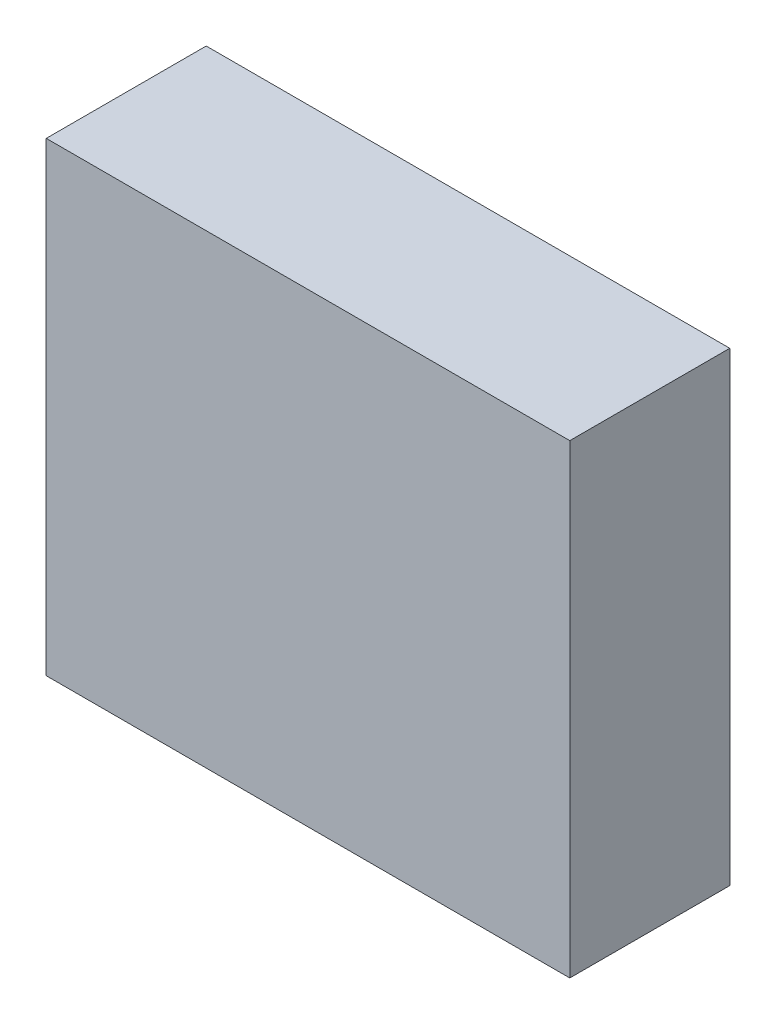
ISO-10303-21;
HEADER;
FILE_DESCRIPTION(('STEP AP214'),'2;1');
FILE_NAME('part.step','',(''),(''),'','','');
FILE_SCHEMA(('AUTOMOTIVE_DESIGN { 1 0 10303 214 1 1 1 1 }'));
ENDSEC;
DATA;
#1=APPLICATION_CONTEXT('core data for automotive mechanical design processes');
#2=APPLICATION_PROTOCOL_DEFINITION('international standard','automotive_design',2000,#1);
#3=PRODUCT_CONTEXT('',#1,'mechanical');
#4=PRODUCT('Part','Part','',(#3));
#5=PRODUCT_RELATED_PRODUCT_CATEGORY('part','',(#4));
#6=PRODUCT_DEFINITION_FORMATION('','',#4);
#7=PRODUCT_DEFINITION_CONTEXT('part definition',#1,'design');
#8=PRODUCT_DEFINITION('design','',#6,#7);
#9=PRODUCT_DEFINITION_SHAPE('','',#8);
#10=(LENGTH_UNIT() NAMED_UNIT(*) SI_UNIT(.MILLI.,.METRE.));
#11=(NAMED_UNIT(*) PLANE_ANGLE_UNIT() SI_UNIT($,.RADIAN.));
#12=(NAMED_UNIT(*) SI_UNIT($,.STERADIAN.) SOLID_ANGLE_UNIT());
#13=UNCERTAINTY_MEASURE_WITH_UNIT(LENGTH_MEASURE(1.E-05),#10,'distance_accuracy_value','');
#14=(GEOMETRIC_REPRESENTATION_CONTEXT(3) GLOBAL_UNCERTAINTY_ASSIGNED_CONTEXT((#13)) GLOBAL_UNIT_ASSIGNED_CONTEXT((#10,
#11,#12)) REPRESENTATION_CONTEXT('',''));
#15=CARTESIAN_POINT('',(0.,0.,0.));
#16=DIRECTION('',(0.,0.,1.));
#17=DIRECTION('',(1.,0.,0.));
#18=AXIS2_PLACEMENT_3D('',#15,#16,#17);
#19=CARTESIAN_POINT('',(-0.90000074,-0.80000094,0.5499989));
#20=DIRECTION('',(0.,0.,1.));
#21=DIRECTION('',(1.,0.,0.));
#22=AXIS2_PLACEMENT_3D('',#19,#20,#21);
#23=PLANE('',#22);
#24=DIRECTION('',(-1.,0.,0.));
#25=VECTOR('',#24,1.);
#26=CARTESIAN_POINT('',(0.90000074,-0.80000094,0.5499989));
#27=LINE('',#26,#25);
#28=CARTESIAN_POINT('',(0.90000074,-0.80000094,0.5499989));
#29=VERTEX_POINT('',#28);
#30=CARTESIAN_POINT('',(-0.90000074,-0.80000094,0.5499989));
#31=VERTEX_POINT('',#30);
#32=EDGE_CURVE('E26',#29,#31,#27,.T.);
#33=ORIENTED_EDGE('',*,*,#32,.F.);
#34=DIRECTION('',(0.,-1.,0.));
#35=VECTOR('',#34,1.);
#36=CARTESIAN_POINT('',(0.90000074,0.80000094,0.5499989));
#37=LINE('',#36,#35);
#38=CARTESIAN_POINT('',(0.90000074,0.80000094,0.5499989));
#39=VERTEX_POINT('',#38);
#40=EDGE_CURVE('E20',#39,#29,#37,.T.);
#41=ORIENTED_EDGE('',*,*,#40,.F.);
#42=DIRECTION('',(1.,0.,0.));
#43=VECTOR('',#42,1.);
#44=CARTESIAN_POINT('',(-0.90000074,0.80000094,0.5499989));
#45=LINE('',#44,#43);
#46=CARTESIAN_POINT('',(-0.90000074,0.80000094,0.5499989));
#47=VERTEX_POINT('',#46);
#48=EDGE_CURVE('E71',#47,#39,#45,.T.);
#49=ORIENTED_EDGE('',*,*,#48,.F.);
#50=DIRECTION('',(0.,1.,0.));
#51=VECTOR('',#50,1.);
#52=CARTESIAN_POINT('',(-0.90000074,-0.80000094,0.5499989));
#53=LINE('',#52,#51);
#54=EDGE_CURVE('E108',#31,#47,#53,.T.);
#55=ORIENTED_EDGE('',*,*,#54,.F.);
#56=EDGE_LOOP('',(#33,#41,#49,#55));
#57=FACE_BOUND('',#56,.T.);
#58=ADVANCED_FACE('F17',(#57),#23,.T.);
#59=CARTESIAN_POINT('',(-0.90000074,-0.80000094,0.));
#60=DIRECTION('',(0.,0.,1.));
#61=DIRECTION('',(1.,0.,0.));
#62=AXIS2_PLACEMENT_3D('',#59,#60,#61);
#63=PLANE('',#62);
#64=DIRECTION('',(0.,1.,0.));
#65=VECTOR('',#64,1.);
#66=CARTESIAN_POINT('',(-0.90000074,-0.80000094,0.));
#67=LINE('',#66,#65);
#68=CARTESIAN_POINT('',(-0.90000074,-0.80000094,0.));
#69=VERTEX_POINT('',#68);
#70=CARTESIAN_POINT('',(-0.90000074,0.80000094,0.));
#71=VERTEX_POINT('',#70);
#72=EDGE_CURVE('E91',#69,#71,#67,.T.);
#73=ORIENTED_EDGE('',*,*,#72,.T.);
#74=DIRECTION('',(1.,0.,0.));
#75=VECTOR('',#74,1.);
#76=CARTESIAN_POINT('',(-0.90000074,0.80000094,0.));
#77=LINE('',#76,#75);
#78=CARTESIAN_POINT('',(0.90000074,0.80000094,0.));
#79=VERTEX_POINT('',#78);
#80=EDGE_CURVE('E77',#71,#79,#77,.T.);
#81=ORIENTED_EDGE('',*,*,#80,.T.);
#82=DIRECTION('',(0.,-1.,0.));
#83=VECTOR('',#82,1.);
#84=CARTESIAN_POINT('',(0.90000074,0.80000094,0.));
#85=LINE('',#84,#83);
#86=CARTESIAN_POINT('',(0.90000074,-0.80000094,0.));
#87=VERTEX_POINT('',#86);
#88=EDGE_CURVE('E81',#79,#87,#85,.T.);
#89=ORIENTED_EDGE('',*,*,#88,.T.);
#90=DIRECTION('',(-1.,0.,0.));
#91=VECTOR('',#90,1.);
#92=CARTESIAN_POINT('',(0.90000074,-0.80000094,0.));
#93=LINE('',#92,#91);
#94=EDGE_CURVE('E11',#87,#69,#93,.T.);
#95=ORIENTED_EDGE('',*,*,#94,.T.);
#96=EDGE_LOOP('',(#73,#81,#89,#95));
#97=FACE_BOUND('',#96,.T.);
#98=ADVANCED_FACE('F103',(#97),#63,.F.);
#99=CARTESIAN_POINT('',(0.90000074,-0.80000094,0.));
#100=DIRECTION('',(0.,-1.,0.));
#101=DIRECTION('',(0.,0.,-1.));
#102=AXIS2_PLACEMENT_3D('',#99,#100,#101);
#103=PLANE('',#102);
#104=DIRECTION('',(0.,0.,1.));
#105=VECTOR('',#104,1.);
#106=CARTESIAN_POINT('',(0.90000074,-0.80000094,0.));
#107=LINE('',#106,#105);
#108=EDGE_CURVE('E76',#87,#29,#107,.T.);
#109=ORIENTED_EDGE('',*,*,#108,.T.);
#110=ORIENTED_EDGE('',*,*,#32,.T.);
#111=DIRECTION('',(0.,0.,1.));
#112=VECTOR('',#111,1.);
#113=CARTESIAN_POINT('',(-0.90000074,-0.80000094,0.));
#114=LINE('',#113,#112);
#115=EDGE_CURVE('E114',#69,#31,#114,.T.);
#116=ORIENTED_EDGE('',*,*,#115,.F.);
#117=ORIENTED_EDGE('',*,*,#94,.F.);
#118=EDGE_LOOP('',(#109,#110,#116,#117));
#119=FACE_BOUND('',#118,.T.);
#120=ADVANCED_FACE('F130',(#119),#103,.T.);
#121=CARTESIAN_POINT('',(0.90000074,0.80000094,0.));
#122=DIRECTION('',(1.,0.,0.));
#123=DIRECTION('',(0.,1.,0.));
#124=AXIS2_PLACEMENT_3D('',#121,#122,#123);
#125=PLANE('',#124);
#126=DIRECTION('',(0.,0.,1.));
#127=VECTOR('',#126,1.);
#128=CARTESIAN_POINT('',(0.90000074,0.80000094,0.));
#129=LINE('',#128,#127);
#130=EDGE_CURVE('E79',#79,#39,#129,.T.);
#131=ORIENTED_EDGE('',*,*,#130,.T.);
#132=ORIENTED_EDGE('',*,*,#40,.T.);
#133=ORIENTED_EDGE('',*,*,#108,.F.);
#134=ORIENTED_EDGE('',*,*,#88,.F.);
#135=EDGE_LOOP('',(#131,#132,#133,#134));
#136=FACE_BOUND('',#135,.T.);
#137=ADVANCED_FACE('F80',(#136),#125,.T.);
#138=CARTESIAN_POINT('',(-0.90000074,0.80000094,0.));
#139=DIRECTION('',(0.,1.,0.));
#140=DIRECTION('',(1.,0.,0.));
#141=AXIS2_PLACEMENT_3D('',#138,#139,#140);
#142=PLANE('',#141);
#143=DIRECTION('',(0.,0.,1.));
#144=VECTOR('',#143,1.);
#145=CARTESIAN_POINT('',(-0.90000074,0.80000094,0.));
#146=LINE('',#145,#144);
#147=EDGE_CURVE('E88',#71,#47,#146,.T.);
#148=ORIENTED_EDGE('',*,*,#147,.T.);
#149=ORIENTED_EDGE('',*,*,#48,.T.);
#150=ORIENTED_EDGE('',*,*,#130,.F.);
#151=ORIENTED_EDGE('',*,*,#80,.F.);
#152=EDGE_LOOP('',(#148,#149,#150,#151));
#153=FACE_BOUND('',#152,.T.);
#154=ADVANCED_FACE('F86',(#153),#142,.T.);
#155=CARTESIAN_POINT('',(-0.90000074,-0.80000094,0.));
#156=DIRECTION('',(-1.,0.,0.));
#157=DIRECTION('',(0.,0.,1.));
#158=AXIS2_PLACEMENT_3D('',#155,#156,#157);
#159=PLANE('',#158);
#160=ORIENTED_EDGE('',*,*,#115,.T.);
#161=ORIENTED_EDGE('',*,*,#54,.T.);
#162=ORIENTED_EDGE('',*,*,#147,.F.);
#163=ORIENTED_EDGE('',*,*,#72,.F.);
#164=EDGE_LOOP('',(#160,#161,#162,#163));
#165=FACE_BOUND('',#164,.T.);
#166=ADVANCED_FACE('F107',(#165),#159,.T.);
#167=CLOSED_SHELL('',(#58,#98,#120,#137,#154,#166));
#168=MANIFOLD_SOLID_BREP('B1',#167);
#169=ADVANCED_BREP_SHAPE_REPRESENTATION('',(#18,#168),#14);
#170=SHAPE_DEFINITION_REPRESENTATION(#9,#169);
ENDSEC;
END-ISO-10303-21;
